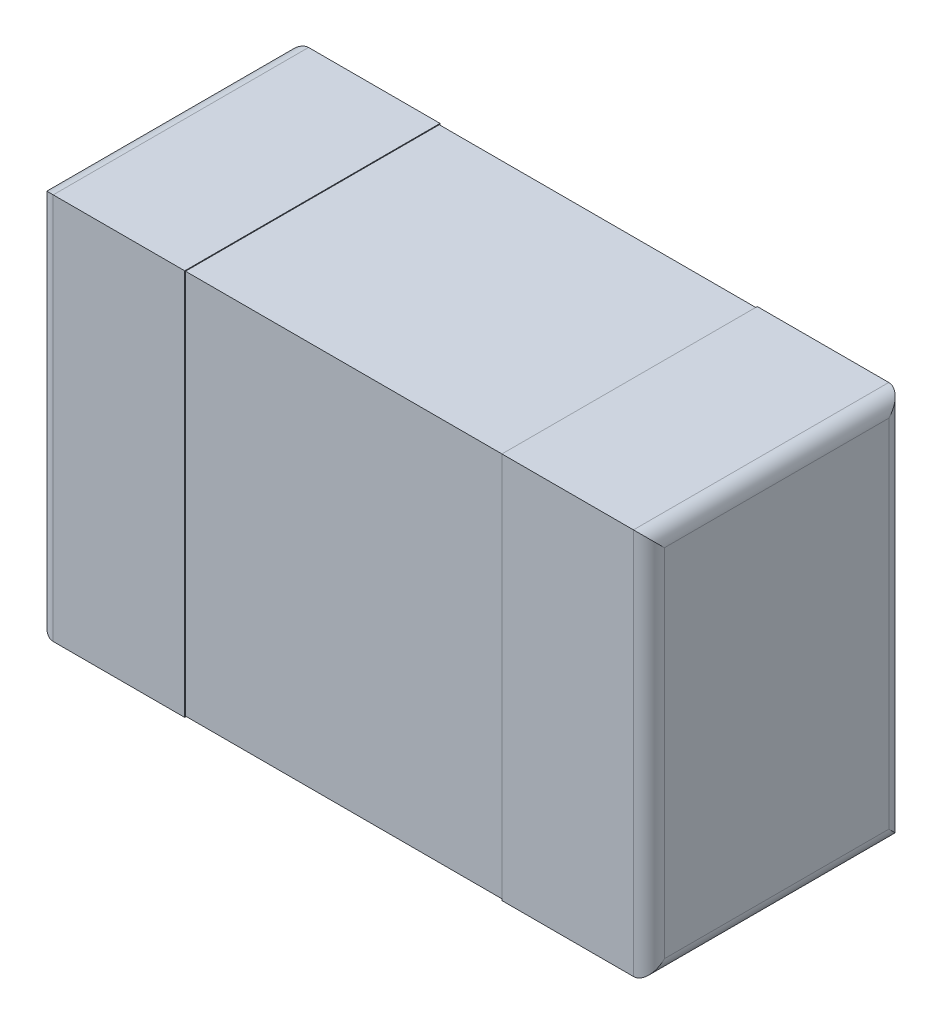
ISO-10303-21;
HEADER;
FILE_DESCRIPTION(('STEP AP214'),'2;1');
FILE_NAME('part.step','',(''),(''),'','','');
FILE_SCHEMA(('AUTOMOTIVE_DESIGN { 1 0 10303 214 1 1 1 1 }'));
ENDSEC;
DATA;
#1=APPLICATION_CONTEXT('core data for automotive mechanical design processes');
#2=APPLICATION_PROTOCOL_DEFINITION('international standard','automotive_design',2000,#1);
#3=PRODUCT_CONTEXT('',#1,'mechanical');
#4=PRODUCT('Part','Part','',(#3));
#5=PRODUCT_RELATED_PRODUCT_CATEGORY('part','',(#4));
#6=PRODUCT_DEFINITION_FORMATION('','',#4);
#7=PRODUCT_DEFINITION_CONTEXT('part definition',#1,'design');
#8=PRODUCT_DEFINITION('design','',#6,#7);
#9=PRODUCT_DEFINITION_SHAPE('','',#8);
#10=(LENGTH_UNIT() NAMED_UNIT(*) SI_UNIT(.MILLI.,.METRE.));
#11=(NAMED_UNIT(*) PLANE_ANGLE_UNIT() SI_UNIT($,.RADIAN.));
#12=(NAMED_UNIT(*) SI_UNIT($,.STERADIAN.) SOLID_ANGLE_UNIT());
#13=UNCERTAINTY_MEASURE_WITH_UNIT(LENGTH_MEASURE(1.E-05),#10,'distance_accuracy_value','');
#14=(GEOMETRIC_REPRESENTATION_CONTEXT(3) GLOBAL_UNCERTAINTY_ASSIGNED_CONTEXT((#13)) GLOBAL_UNIT_ASSIGNED_CONTEXT((#10,
#11,#12)) REPRESENTATION_CONTEXT('',''));
#15=CARTESIAN_POINT('',(0.,0.,0.));
#16=DIRECTION('',(0.,0.,1.));
#17=DIRECTION('',(1.,0.,0.));
#18=AXIS2_PLACEMENT_3D('',#15,#16,#17);
#19=CARTESIAN_POINT('',(0.,0.,0.));
#20=DIRECTION('',(0.,0.,1.));
#21=DIRECTION('',(1.,0.,0.));
#22=AXIS2_PLACEMENT_3D('',#19,#20,#21);
#23=PLANE('',#22);
#24=DIRECTION('',(-1.,0.,0.));
#25=VECTOR('',#24,1.);
#26=CARTESIAN_POINT('',(2.0066,1.27,0.));
#27=LINE('',#26,#25);
#28=CARTESIAN_POINT('',(1.9558,1.27,0.));
#29=VERTEX_POINT('',#28);
#30=CARTESIAN_POINT('',(1.524,1.27,0.));
#31=VERTEX_POINT('',#30);
#32=EDGE_CURVE('E42',#29,#31,#27,.T.);
#33=ORIENTED_EDGE('',*,*,#32,.F.);
#34=DIRECTION('',(0.,-1.,0.));
#35=VECTOR('',#34,1.);
#36=CARTESIAN_POINT('',(1.9558,0.,0.));
#37=LINE('',#36,#35);
#38=CARTESIAN_POINT('',(1.9558,0.,0.));
#39=VERTEX_POINT('',#38);
#40=EDGE_CURVE('E11',#29,#39,#37,.T.);
#41=ORIENTED_EDGE('',*,*,#40,.T.);
#42=DIRECTION('',(1.,0.,0.));
#43=VECTOR('',#42,1.);
#44=CARTESIAN_POINT('',(0.,0.,0.));
#45=LINE('',#44,#43);
#46=CARTESIAN_POINT('',(1.524,0.,0.));
#47=VERTEX_POINT('',#46);
#48=EDGE_CURVE('E209',#47,#39,#45,.T.);
#49=ORIENTED_EDGE('',*,*,#48,.F.);
#50=DIRECTION('',(0.,1.,0.));
#51=VECTOR('',#50,1.);
#52=CARTESIAN_POINT('',(1.524,0.,0.));
#53=LINE('',#52,#51);
#54=EDGE_CURVE('E29',#47,#31,#53,.T.);
#55=ORIENTED_EDGE('',*,*,#54,.T.);
#56=EDGE_LOOP('',(#33,#41,#49,#55));
#57=FACE_BOUND('',#56,.T.);
#58=ADVANCED_FACE('F18',(#57),#23,.F.);
#59=CARTESIAN_POINT('',(0.,0.,0.));
#60=DIRECTION('',(0.,0.,1.));
#61=DIRECTION('',(1.,0.,0.));
#62=AXIS2_PLACEMENT_3D('',#59,#60,#61);
#63=PLANE('',#62);
#64=DIRECTION('',(1.,0.,0.));
#65=VECTOR('',#64,1.);
#66=CARTESIAN_POINT('',(0.,0.,0.));
#67=LINE('',#66,#65);
#68=CARTESIAN_POINT('',(0.0508,0.,0.));
#69=VERTEX_POINT('',#68);
#70=CARTESIAN_POINT('',(0.4826,0.,0.));
#71=VERTEX_POINT('',#70);
#72=EDGE_CURVE('E237',#69,#71,#67,.T.);
#73=ORIENTED_EDGE('',*,*,#72,.F.);
#74=DIRECTION('',(0.,1.,0.));
#75=VECTOR('',#74,1.);
#76=CARTESIAN_POINT('',(0.0508,0.,0.));
#77=LINE('',#76,#75);
#78=CARTESIAN_POINT('',(0.0508,1.27,0.));
#79=VERTEX_POINT('',#78);
#80=EDGE_CURVE('E252',#69,#79,#77,.T.);
#81=ORIENTED_EDGE('',*,*,#80,.T.);
#82=DIRECTION('',(-1.,0.,0.));
#83=VECTOR('',#82,1.);
#84=CARTESIAN_POINT('',(2.0066,1.27,0.));
#85=LINE('',#84,#83);
#86=CARTESIAN_POINT('',(0.4826,1.27,0.));
#87=VERTEX_POINT('',#86);
#88=EDGE_CURVE('E210',#87,#79,#85,.T.);
#89=ORIENTED_EDGE('',*,*,#88,.F.);
#90=DIRECTION('',(0.,-1.,0.));
#91=VECTOR('',#90,1.);
#92=CARTESIAN_POINT('',(0.4826,0.,0.));
#93=LINE('',#92,#91);
#94=EDGE_CURVE('E256',#87,#71,#93,.T.);
#95=ORIENTED_EDGE('',*,*,#94,.T.);
#96=EDGE_LOOP('',(#73,#81,#89,#95));
#97=FACE_BOUND('',#96,.T.);
#98=ADVANCED_FACE('F386',(#97),#63,.F.);
#99=CARTESIAN_POINT('',(1.524,0.00254000000000009,-1.68265745417451));
#100=DIRECTION('',(0.,1.,0.));
#101=DIRECTION('',(1.,0.,0.));
#102=AXIS2_PLACEMENT_3D('',#99,#100,#101);
#103=PLANE('',#102);
#104=DIRECTION('',(-1.,0.,0.));
#105=VECTOR('',#104,1.);
#106=CARTESIAN_POINT('',(1.524,0.00254000000000009,0.00253999999999988));
#107=LINE('',#106,#105);
#108=CARTESIAN_POINT('',(1.524,0.00254000000000009,0.0025399999999999));
#109=VERTEX_POINT('',#108);
#110=CARTESIAN_POINT('',(0.4826,0.00254000000000009,0.0025399999999999));
#111=VERTEX_POINT('',#110);
#112=EDGE_CURVE('E235',#109,#111,#107,.T.);
#113=ORIENTED_EDGE('',*,*,#112,.F.);
#114=DIRECTION('',(0.,0.,1.));
#115=VECTOR('',#114,1.);
#116=CARTESIAN_POINT('',(1.524,0.00254000000000009,-1.68265745417451));
#117=LINE('',#116,#115);
#118=CARTESIAN_POINT('',(1.524,0.00254000000000009,0.83566));
#119=VERTEX_POINT('',#118);
#120=EDGE_CURVE('E186',#109,#119,#117,.T.);
#121=ORIENTED_EDGE('',*,*,#120,.T.);
#122=DIRECTION('',(-1.,0.,0.));
#123=VECTOR('',#122,1.);
#124=CARTESIAN_POINT('',(1.524,0.00254000000000009,0.83566));
#125=LINE('',#124,#123);
#126=CARTESIAN_POINT('',(0.4826,0.00254,0.83566));
#127=VERTEX_POINT('',#126);
#128=EDGE_CURVE('E183',#119,#127,#125,.T.);
#129=ORIENTED_EDGE('',*,*,#128,.T.);
#130=DIRECTION('',(0.,0.,1.));
#131=VECTOR('',#130,1.);
#132=CARTESIAN_POINT('',(0.4826,0.00254,-1.68265745417451));
#133=LINE('',#132,#131);
#134=EDGE_CURVE('E170',#111,#127,#133,.T.);
#135=ORIENTED_EDGE('',*,*,#134,.F.);
#136=EDGE_LOOP('',(#113,#121,#129,#135));
#137=FACE_BOUND('',#136,.T.);
#138=ADVANCED_FACE('F184',(#137),#103,.F.);
#139=CARTESIAN_POINT('',(0.4826,1.26746,-1.68265745417451));
#140=DIRECTION('',(0.,-1.,0.));
#141=DIRECTION('',(0.,0.,-1.));
#142=AXIS2_PLACEMENT_3D('',#139,#140,#141);
#143=PLANE('',#142);
#144=DIRECTION('',(1.,0.,0.));
#145=VECTOR('',#144,1.);
#146=CARTESIAN_POINT('',(0.4826,1.26746,0.00253999999999988));
#147=LINE('',#146,#145);
#148=CARTESIAN_POINT('',(0.4826,1.26746,0.0025399999999999));
#149=VERTEX_POINT('',#148);
#150=CARTESIAN_POINT('',(1.524,1.26746,0.0025399999999999));
#151=VERTEX_POINT('',#150);
#152=EDGE_CURVE('E231',#149,#151,#147,.T.);
#153=ORIENTED_EDGE('',*,*,#152,.F.);
#154=DIRECTION('',(0.,0.,1.));
#155=VECTOR('',#154,1.);
#156=CARTESIAN_POINT('',(0.4826,1.26746,-1.68265745417451));
#157=LINE('',#156,#155);
#158=CARTESIAN_POINT('',(0.4826,1.26746,0.83566));
#159=VERTEX_POINT('',#158);
#160=EDGE_CURVE('E191',#149,#159,#157,.T.);
#161=ORIENTED_EDGE('',*,*,#160,.T.);
#162=DIRECTION('',(1.,0.,0.));
#163=VECTOR('',#162,1.);
#164=CARTESIAN_POINT('',(0.4826,1.26746,0.83566));
#165=LINE('',#164,#163);
#166=CARTESIAN_POINT('',(1.524,1.26746,0.83566));
#167=VERTEX_POINT('',#166);
#168=EDGE_CURVE('E195',#159,#167,#165,.T.);
#169=ORIENTED_EDGE('',*,*,#168,.T.);
#170=DIRECTION('',(0.,0.,1.));
#171=VECTOR('',#170,1.);
#172=CARTESIAN_POINT('',(1.524,1.26746,-1.68265745417451));
#173=LINE('',#172,#171);
#174=EDGE_CURVE('E203',#151,#167,#173,.T.);
#175=ORIENTED_EDGE('',*,*,#174,.F.);
#176=EDGE_LOOP('',(#153,#161,#169,#175));
#177=FACE_BOUND('',#176,.T.);
#178=ADVANCED_FACE('F449',(#177),#143,.F.);
#179=CARTESIAN_POINT('',(2.0066,1.27,0.8382));
#180=DIRECTION('',(0.,-1.,0.));
#181=DIRECTION('',(0.,0.,-1.));
#182=AXIS2_PLACEMENT_3D('',#179,#180,#181);
#183=PLANE('',#182);
#184=DIRECTION('',(-1.,0.,0.));
#185=VECTOR('',#184,1.);
#186=CARTESIAN_POINT('',(2.0066,1.27,0.8382));
#187=LINE('',#186,#185);
#188=CARTESIAN_POINT('',(1.9558,1.27,0.8382));
#189=VERTEX_POINT('',#188);
#190=CARTESIAN_POINT('',(1.524,1.27,0.8382));
#191=VERTEX_POINT('',#190);
#192=EDGE_CURVE('E291',#189,#191,#187,.T.);
#193=ORIENTED_EDGE('',*,*,#192,.F.);
#194=DIRECTION('',(0.,0.,-1.));
#195=VECTOR('',#194,1.);
#196=CARTESIAN_POINT('',(1.9558,1.27,0.8382));
#197=LINE('',#196,#195);
#198=EDGE_CURVE('E211',#189,#29,#197,.T.);
#199=ORIENTED_EDGE('',*,*,#198,.T.);
#200=ORIENTED_EDGE('',*,*,#32,.T.);
#201=DIRECTION('',(0.,0.,1.));
#202=VECTOR('',#201,1.);
#203=CARTESIAN_POINT('',(1.524,1.27,0.83566));
#204=LINE('',#203,#202);
#205=EDGE_CURVE('E260',#31,#191,#204,.T.);
#206=ORIENTED_EDGE('',*,*,#205,.T.);
#207=EDGE_LOOP('',(#193,#199,#200,#206));
#208=FACE_BOUND('',#207,.T.);
#209=ADVANCED_FACE('F369',(#208),#183,.F.);
#210=CARTESIAN_POINT('',(0.,0.,0.8382));
#211=DIRECTION('',(0.,1.,0.));
#212=DIRECTION('',(1.,0.,0.));
#213=AXIS2_PLACEMENT_3D('',#210,#211,#212);
#214=PLANE('',#213);
#215=DIRECTION('',(1.,0.,0.));
#216=VECTOR('',#215,1.);
#217=CARTESIAN_POINT('',(0.,0.,0.8382));
#218=LINE('',#217,#216);
#219=CARTESIAN_POINT('',(0.0508,0.,0.8382));
#220=VERTEX_POINT('',#219);
#221=CARTESIAN_POINT('',(0.4826,0.,0.8382));
#222=VERTEX_POINT('',#221);
#223=EDGE_CURVE('E296',#220,#222,#218,.T.);
#224=ORIENTED_EDGE('',*,*,#223,.F.);
#225=DIRECTION('',(0.,0.,-1.));
#226=VECTOR('',#225,1.);
#227=CARTESIAN_POINT('',(0.0508,0.,0.8382));
#228=LINE('',#227,#226);
#229=EDGE_CURVE('E241',#220,#69,#228,.T.);
#230=ORIENTED_EDGE('',*,*,#229,.T.);
#231=ORIENTED_EDGE('',*,*,#72,.T.);
#232=DIRECTION('',(0.,0.,1.));
#233=VECTOR('',#232,1.);
#234=CARTESIAN_POINT('',(0.4826,0.,0.83566));
#235=LINE('',#234,#233);
#236=EDGE_CURVE('E242',#71,#222,#235,.T.);
#237=ORIENTED_EDGE('',*,*,#236,.T.);
#238=EDGE_LOOP('',(#224,#230,#231,#237));
#239=FACE_BOUND('',#238,.T.);
#240=ADVANCED_FACE('F420',(#239),#214,.F.);
#241=CARTESIAN_POINT('',(0.,0.,0.8382));
#242=DIRECTION('',(0.,1.,0.));
#243=DIRECTION('',(1.,0.,0.));
#244=AXIS2_PLACEMENT_3D('',#241,#242,#243);
#245=PLANE('',#244);
#246=ORIENTED_EDGE('',*,*,#48,.T.);
#247=DIRECTION('',(0.,0.,1.));
#248=VECTOR('',#247,1.);
#249=CARTESIAN_POINT('',(1.9558,0.,0.8382));
#250=LINE('',#249,#248);
#251=CARTESIAN_POINT('',(1.9558,0.,0.8382));
#252=VERTEX_POINT('',#251);
#253=EDGE_CURVE('E206',#39,#252,#250,.T.);
#254=ORIENTED_EDGE('',*,*,#253,.T.);
#255=DIRECTION('',(1.,0.,0.));
#256=VECTOR('',#255,1.);
#257=CARTESIAN_POINT('',(0.,0.,0.8382));
#258=LINE('',#257,#256);
#259=CARTESIAN_POINT('',(1.524,0.,0.8382));
#260=VERTEX_POINT('',#259);
#261=EDGE_CURVE('E297',#260,#252,#258,.T.);
#262=ORIENTED_EDGE('',*,*,#261,.F.);
#263=DIRECTION('',(0.,0.,1.));
#264=VECTOR('',#263,1.);
#265=CARTESIAN_POINT('',(1.524,0.,0.83566));
#266=LINE('',#265,#264);
#267=EDGE_CURVE('E22',#47,#260,#266,.T.);
#268=ORIENTED_EDGE('',*,*,#267,.F.);
#269=EDGE_LOOP('',(#246,#254,#262,#268));
#270=FACE_BOUND('',#269,.T.);
#271=ADVANCED_FACE('F418',(#270),#245,.F.);
#272=CARTESIAN_POINT('',(2.0066,1.27,0.8382));
#273=DIRECTION('',(0.,-1.,0.));
#274=DIRECTION('',(0.,0.,-1.));
#275=AXIS2_PLACEMENT_3D('',#272,#273,#274);
#276=PLANE('',#275);
#277=ORIENTED_EDGE('',*,*,#88,.T.);
#278=DIRECTION('',(0.,0.,1.));
#279=VECTOR('',#278,1.);
#280=CARTESIAN_POINT('',(0.0508,1.27,0.8382));
#281=LINE('',#280,#279);
#282=CARTESIAN_POINT('',(0.0508,1.27,0.8382));
#283=VERTEX_POINT('',#282);
#284=EDGE_CURVE('E243',#79,#283,#281,.T.);
#285=ORIENTED_EDGE('',*,*,#284,.T.);
#286=DIRECTION('',(-1.,0.,0.));
#287=VECTOR('',#286,1.);
#288=CARTESIAN_POINT('',(2.0066,1.27,0.8382));
#289=LINE('',#288,#287);
#290=CARTESIAN_POINT('',(0.4826,1.27,0.8382));
#291=VERTEX_POINT('',#290);
#292=EDGE_CURVE('E247',#291,#283,#289,.T.);
#293=ORIENTED_EDGE('',*,*,#292,.F.);
#294=DIRECTION('',(0.,0.,1.));
#295=VECTOR('',#294,1.);
#296=CARTESIAN_POINT('',(0.4826,1.27,0.83566));
#297=LINE('',#296,#295);
#298=EDGE_CURVE('E198',#87,#291,#297,.T.);
#299=ORIENTED_EDGE('',*,*,#298,.F.);
#300=EDGE_LOOP('',(#277,#285,#293,#299));
#301=FACE_BOUND('',#300,.T.);
#302=ADVANCED_FACE('F397',(#301),#276,.F.);
#303=CARTESIAN_POINT('',(0.,0.,0.8382));
#304=DIRECTION('',(0.,0.,1.));
#305=DIRECTION('',(1.,0.,0.));
#306=AXIS2_PLACEMENT_3D('',#303,#304,#305);
#307=PLANE('',#306);
#308=ORIENTED_EDGE('',*,*,#292,.T.);
#309=DIRECTION('',(0.,-1.,0.));
#310=VECTOR('',#309,1.);
#311=CARTESIAN_POINT('',(0.0508,0.,0.8382));
#312=LINE('',#311,#310);
#313=EDGE_CURVE('E158',#283,#220,#312,.T.);
#314=ORIENTED_EDGE('',*,*,#313,.T.);
#315=ORIENTED_EDGE('',*,*,#223,.T.);
#316=DIRECTION('',(0.,1.,0.));
#317=VECTOR('',#316,1.);
#318=CARTESIAN_POINT('',(0.4826,0.,0.8382));
#319=LINE('',#318,#317);
#320=EDGE_CURVE('E292',#222,#291,#319,.T.);
#321=ORIENTED_EDGE('',*,*,#320,.T.);
#322=EDGE_LOOP('',(#308,#314,#315,#321));
#323=FACE_BOUND('',#322,.T.);
#324=ADVANCED_FACE('F394',(#323),#307,.T.);
#325=CARTESIAN_POINT('',(0.,0.,0.8382));
#326=DIRECTION('',(0.,0.,1.));
#327=DIRECTION('',(1.,0.,0.));
#328=AXIS2_PLACEMENT_3D('',#325,#326,#327);
#329=PLANE('',#328);
#330=ORIENTED_EDGE('',*,*,#261,.T.);
#331=DIRECTION('',(0.,1.,0.));
#332=VECTOR('',#331,1.);
#333=CARTESIAN_POINT('',(1.9558,1.27,0.8382));
#334=LINE('',#333,#332);
#335=EDGE_CURVE('E316',#252,#189,#334,.T.);
#336=ORIENTED_EDGE('',*,*,#335,.T.);
#337=ORIENTED_EDGE('',*,*,#192,.T.);
#338=DIRECTION('',(0.,-1.,0.));
#339=VECTOR('',#338,1.);
#340=CARTESIAN_POINT('',(1.524,1.27,0.8382));
#341=LINE('',#340,#339);
#342=EDGE_CURVE('E287',#191,#260,#341,.T.);
#343=ORIENTED_EDGE('',*,*,#342,.T.);
#344=EDGE_LOOP('',(#330,#336,#337,#343));
#345=FACE_BOUND('',#344,.T.);
#346=ADVANCED_FACE('F20',(#345),#329,.T.);
#347=CARTESIAN_POINT('',(0.,1.27,0.8382));
#348=DIRECTION('',(1.,0.,0.));
#349=DIRECTION('',(0.,1.,0.));
#350=AXIS2_PLACEMENT_3D('',#347,#348,#349);
#351=PLANE('',#350);
#352=DIRECTION('',(0.,-1.,0.));
#353=VECTOR('',#352,1.);
#354=CARTESIAN_POINT('',(0.,1.27,0.0508));
#355=LINE('',#354,#353);
#356=CARTESIAN_POINT('',(0.,1.2192,0.0508));
#357=VERTEX_POINT('',#356);
#358=CARTESIAN_POINT('',(0.,0.0508,0.0508));
#359=VERTEX_POINT('',#358);
#360=EDGE_CURVE('E224',#357,#359,#355,.T.);
#361=ORIENTED_EDGE('',*,*,#360,.T.);
#362=DIRECTION('',(0.,0.,1.));
#363=VECTOR('',#362,1.);
#364=CARTESIAN_POINT('',(0.,0.0508,0.8382));
#365=LINE('',#364,#363);
#366=CARTESIAN_POINT('',(0.,0.0508,0.7874));
#367=VERTEX_POINT('',#366);
#368=EDGE_CURVE('E220',#359,#367,#365,.T.);
#369=ORIENTED_EDGE('',*,*,#368,.T.);
#370=DIRECTION('',(0.,1.,0.));
#371=VECTOR('',#370,1.);
#372=CARTESIAN_POINT('',(0.,1.27,0.7874));
#373=LINE('',#372,#371);
#374=CARTESIAN_POINT('',(0.,1.2192,0.7874));
#375=VERTEX_POINT('',#374);
#376=EDGE_CURVE('E225',#367,#375,#373,.T.);
#377=ORIENTED_EDGE('',*,*,#376,.T.);
#378=DIRECTION('',(0.,0.,-1.));
#379=VECTOR('',#378,1.);
#380=CARTESIAN_POINT('',(0.,1.2192,0.8382));
#381=LINE('',#380,#379);
#382=EDGE_CURVE('E264',#375,#357,#381,.T.);
#383=ORIENTED_EDGE('',*,*,#382,.T.);
#384=EDGE_LOOP('',(#361,#369,#377,#383));
#385=FACE_BOUND('',#384,.T.);
#386=ADVANCED_FACE('F462',(#385),#351,.F.);
#387=CARTESIAN_POINT('',(2.0066,0.,0.8382));
#388=DIRECTION('',(-1.,0.,0.));
#389=DIRECTION('',(0.,0.,1.));
#390=AXIS2_PLACEMENT_3D('',#387,#388,#389);
#391=PLANE('',#390);
#392=DIRECTION('',(0.,1.,0.));
#393=VECTOR('',#392,1.);
#394=CARTESIAN_POINT('',(2.0066,0.,0.0508));
#395=LINE('',#394,#393);
#396=CARTESIAN_POINT('',(2.0066,0.0508,0.0508));
#397=VERTEX_POINT('',#396);
#398=CARTESIAN_POINT('',(2.0066,1.2192,0.0508));
#399=VERTEX_POINT('',#398);
#400=EDGE_CURVE('E268',#397,#399,#395,.T.);
#401=ORIENTED_EDGE('',*,*,#400,.T.);
#402=DIRECTION('',(0.,0.,1.));
#403=VECTOR('',#402,1.);
#404=CARTESIAN_POINT('',(2.0066,1.2192,0.8382));
#405=LINE('',#404,#403);
#406=CARTESIAN_POINT('',(2.0066,1.2192,0.7874));
#407=VERTEX_POINT('',#406);
#408=EDGE_CURVE('E271',#399,#407,#405,.T.);
#409=ORIENTED_EDGE('',*,*,#408,.T.);
#410=DIRECTION('',(0.,-1.,0.));
#411=VECTOR('',#410,1.);
#412=CARTESIAN_POINT('',(2.0066,0.,0.7874));
#413=LINE('',#412,#411);
#414=CARTESIAN_POINT('',(2.0066,0.0508,0.7874));
#415=VERTEX_POINT('',#414);
#416=EDGE_CURVE('E275',#407,#415,#413,.T.);
#417=ORIENTED_EDGE('',*,*,#416,.T.);
#418=DIRECTION('',(0.,0.,-1.));
#419=VECTOR('',#418,1.);
#420=CARTESIAN_POINT('',(2.0066,0.0508,0.8382));
#421=LINE('',#420,#419);
#422=EDGE_CURVE('E355',#415,#397,#421,.T.);
#423=ORIENTED_EDGE('',*,*,#422,.T.);
#424=EDGE_LOOP('',(#401,#409,#417,#423));
#425=FACE_BOUND('',#424,.T.);
#426=ADVANCED_FACE('F381',(#425),#391,.F.);
#427=CARTESIAN_POINT('',(0.4826,0.,0.83566));
#428=DIRECTION('',(1.,0.,0.));
#429=DIRECTION('',(0.,1.,0.));
#430=AXIS2_PLACEMENT_3D('',#427,#428,#429);
#431=PLANE('',#430);
#432=ORIENTED_EDGE('',*,*,#160,.F.);
#433=DIRECTION('',(0.,-1.,0.));
#434=VECTOR('',#433,1.);
#435=CARTESIAN_POINT('',(0.4826,2.51831745417451,0.0025399999999999));
#436=LINE('',#435,#434);
#437=EDGE_CURVE('E178',#149,#111,#436,.T.);
#438=ORIENTED_EDGE('',*,*,#437,.T.);
#439=ORIENTED_EDGE('',*,*,#134,.T.);
#440=DIRECTION('',(0.,1.,0.));
#441=VECTOR('',#440,1.);
#442=CARTESIAN_POINT('',(0.4826,0.,0.83566));
#443=LINE('',#442,#441);
#444=EDGE_CURVE('E176',#127,#159,#443,.T.);
#445=ORIENTED_EDGE('',*,*,#444,.T.);
#446=EDGE_LOOP('',(#432,#438,#439,#445));
#447=FACE_BOUND('',#446,.T.);
#448=ORIENTED_EDGE('',*,*,#298,.T.);
#449=ORIENTED_EDGE('',*,*,#320,.F.);
#450=ORIENTED_EDGE('',*,*,#236,.F.);
#451=ORIENTED_EDGE('',*,*,#94,.F.);
#452=EDGE_LOOP('',(#448,#449,#450,#451));
#453=FACE_BOUND('',#452,.T.);
#454=ADVANCED_FACE('F173',(#447,#453),#431,.T.);
#455=CARTESIAN_POINT('',(1.524,1.27,0.83566));
#456=DIRECTION('',(-1.,0.,0.));
#457=DIRECTION('',(0.,0.,1.));
#458=AXIS2_PLACEMENT_3D('',#455,#456,#457);
#459=PLANE('',#458);
#460=DIRECTION('',(0.,-1.,0.));
#461=VECTOR('',#460,1.);
#462=CARTESIAN_POINT('',(1.524,2.51831745417451,0.0025399999999999));
#463=LINE('',#462,#461);
#464=EDGE_CURVE('E236',#151,#109,#463,.T.);
#465=ORIENTED_EDGE('',*,*,#464,.F.);
#466=ORIENTED_EDGE('',*,*,#174,.T.);
#467=DIRECTION('',(0.,-1.,0.));
#468=VECTOR('',#467,1.);
#469=CARTESIAN_POINT('',(1.524,1.27,0.83566));
#470=LINE('',#469,#468);
#471=EDGE_CURVE('E329',#167,#119,#470,.T.);
#472=ORIENTED_EDGE('',*,*,#471,.T.);
#473=ORIENTED_EDGE('',*,*,#120,.F.);
#474=EDGE_LOOP('',(#465,#466,#472,#473));
#475=FACE_BOUND('',#474,.T.);
#476=ORIENTED_EDGE('',*,*,#267,.T.);
#477=ORIENTED_EDGE('',*,*,#342,.F.);
#478=ORIENTED_EDGE('',*,*,#205,.F.);
#479=ORIENTED_EDGE('',*,*,#54,.F.);
#480=EDGE_LOOP('',(#476,#477,#478,#479));
#481=FACE_BOUND('',#480,.T.);
#482=ADVANCED_FACE('F370',(#475,#481),#459,.T.);
#483=CARTESIAN_POINT('',(0.,0.,0.83566));
#484=DIRECTION('',(0.,0.,-1.));
#485=DIRECTION('',(0.,-1.,0.));
#486=AXIS2_PLACEMENT_3D('',#483,#484,#485);
#487=PLANE('',#486);
#488=ORIENTED_EDGE('',*,*,#471,.F.);
#489=ORIENTED_EDGE('',*,*,#168,.F.);
#490=ORIENTED_EDGE('',*,*,#444,.F.);
#491=ORIENTED_EDGE('',*,*,#128,.F.);
#492=EDGE_LOOP('',(#488,#489,#490,#491));
#493=FACE_BOUND('',#492,.T.);
#494=ADVANCED_FACE('F193',(#493),#487,.F.);
#495=CARTESIAN_POINT('',(0.4826,2.51831745417451,0.0025399999999999));
#496=DIRECTION('',(0.,0.,-1.));
#497=DIRECTION('',(0.,-1.,0.));
#498=AXIS2_PLACEMENT_3D('',#495,#496,#497);
#499=PLANE('',#498);
#500=ORIENTED_EDGE('',*,*,#112,.T.);
#501=ORIENTED_EDGE('',*,*,#437,.F.);
#502=ORIENTED_EDGE('',*,*,#152,.T.);
#503=ORIENTED_EDGE('',*,*,#464,.T.);
#504=EDGE_LOOP('',(#500,#501,#502,#503));
#505=FACE_BOUND('',#504,.T.);
#506=ADVANCED_FACE('F379',(#505),#499,.T.);
#507=CARTESIAN_POINT('',(0.0508,1.2192,0.8382));
#508=DIRECTION('',(0.,0.,-1.));
#509=DIRECTION('',(-1.,0.,0.));
#510=AXIS2_PLACEMENT_3D('',#507,#508,#509);
#511=CYLINDRICAL_SURFACE('',#510,0.0508);
#512=CARTESIAN_POINT('',(0.0508,1.2192,0.0508));
#513=DIRECTION('',(0.,-0.707106781186548,-0.707106781186548));
#514=DIRECTION('',(0.,0.707106781186548,-0.707106781186548));
#515=AXIS2_PLACEMENT_3D('',#512,#513,#514);
#516=ELLIPSE('',#515,0.0718420489685533,0.0508);
#517=EDGE_CURVE('E251',#357,#79,#516,.T.);
#518=ORIENTED_EDGE('',*,*,#517,.F.);
#519=ORIENTED_EDGE('',*,*,#382,.F.);
#520=CARTESIAN_POINT('',(0.0508,1.2192,0.7874));
#521=DIRECTION('',(0.,-0.707106781186548,0.707106781186548));
#522=DIRECTION('',(0.,-0.707106781186548,-0.707106781186548));
#523=AXIS2_PLACEMENT_3D('',#520,#521,#522);
#524=ELLIPSE('',#523,0.0718420489685533,0.0508);
#525=EDGE_CURVE('E248',#283,#375,#524,.T.);
#526=ORIENTED_EDGE('',*,*,#525,.F.);
#527=ORIENTED_EDGE('',*,*,#284,.F.);
#528=EDGE_LOOP('',(#518,#519,#526,#527));
#529=FACE_BOUND('',#528,.T.);
#530=ADVANCED_FACE('F461',(#529),#511,.T.);
#531=CARTESIAN_POINT('',(0.0508,0.,0.7874));
#532=DIRECTION('',(0.,1.,0.));
#533=DIRECTION('',(-1.,0.,0.));
#534=AXIS2_PLACEMENT_3D('',#531,#532,#533);
#535=CYLINDRICAL_SURFACE('',#534,0.0508);
#536=ORIENTED_EDGE('',*,*,#525,.T.);
#537=ORIENTED_EDGE('',*,*,#376,.F.);
#538=CARTESIAN_POINT('',(0.0508,0.0508,0.7874));
#539=DIRECTION('',(0.,-0.707106781186548,-0.707106781186548));
#540=DIRECTION('',(0.,0.707106781186548,-0.707106781186548));
#541=AXIS2_PLACEMENT_3D('',#538,#539,#540);
#542=ELLIPSE('',#541,0.0718420489685533,0.0508);
#543=EDGE_CURVE('E333',#220,#367,#542,.T.);
#544=ORIENTED_EDGE('',*,*,#543,.F.);
#545=ORIENTED_EDGE('',*,*,#313,.F.);
#546=EDGE_LOOP('',(#536,#537,#544,#545));
#547=FACE_BOUND('',#546,.T.);
#548=ADVANCED_FACE('F411',(#547),#535,.T.);
#549=CARTESIAN_POINT('',(0.0508,1.27,0.0508));
#550=DIRECTION('',(0.,-1.,0.));
#551=DIRECTION('',(1.,0.,0.));
#552=AXIS2_PLACEMENT_3D('',#549,#550,#551);
#553=CYLINDRICAL_SURFACE('',#552,0.0508);
#554=ORIENTED_EDGE('',*,*,#517,.T.);
#555=ORIENTED_EDGE('',*,*,#80,.F.);
#556=CARTESIAN_POINT('',(0.0508,0.0508,0.0508));
#557=DIRECTION('',(0.,-0.707106781186548,0.707106781186548));
#558=DIRECTION('',(0.,-0.707106781186548,-0.707106781186548));
#559=AXIS2_PLACEMENT_3D('',#556,#557,#558);
#560=ELLIPSE('',#559,0.0718420489685533,0.0508);
#561=EDGE_CURVE('E229',#359,#69,#560,.T.);
#562=ORIENTED_EDGE('',*,*,#561,.F.);
#563=ORIENTED_EDGE('',*,*,#360,.F.);
#564=EDGE_LOOP('',(#554,#555,#562,#563));
#565=FACE_BOUND('',#564,.T.);
#566=ADVANCED_FACE('F403',(#565),#553,.T.);
#567=CARTESIAN_POINT('',(0.0508,0.0508,0.8382));
#568=DIRECTION('',(0.,0.,-1.));
#569=DIRECTION('',(-1.,0.,0.));
#570=AXIS2_PLACEMENT_3D('',#567,#568,#569);
#571=CYLINDRICAL_SURFACE('',#570,0.0508);
#572=ORIENTED_EDGE('',*,*,#543,.T.);
#573=ORIENTED_EDGE('',*,*,#368,.F.);
#574=ORIENTED_EDGE('',*,*,#561,.T.);
#575=ORIENTED_EDGE('',*,*,#229,.F.);
#576=EDGE_LOOP('',(#572,#573,#574,#575));
#577=FACE_BOUND('',#576,.T.);
#578=ADVANCED_FACE('F399',(#577),#571,.T.);
#579=CARTESIAN_POINT('',(1.9558,0.0508,0.8382));
#580=DIRECTION('',(0.,0.,-1.));
#581=DIRECTION('',(-1.,0.,0.));
#582=AXIS2_PLACEMENT_3D('',#579,#580,#581);
#583=CYLINDRICAL_SURFACE('',#582,0.0508);
#584=CARTESIAN_POINT('',(1.9558,0.0508,0.0508));
#585=DIRECTION('',(0.,0.707106781186548,-0.707106781186548));
#586=DIRECTION('',(0.,-0.707106781186548,-0.707106781186548));
#587=AXIS2_PLACEMENT_3D('',#584,#585,#586);
#588=ELLIPSE('',#587,0.0718420489685533,0.0508);
#589=EDGE_CURVE('E218',#397,#39,#588,.T.);
#590=ORIENTED_EDGE('',*,*,#589,.F.);
#591=ORIENTED_EDGE('',*,*,#422,.F.);
#592=CARTESIAN_POINT('',(1.9558,0.0508,0.7874));
#593=DIRECTION('',(0.,0.707106781186548,0.707106781186548));
#594=DIRECTION('',(0.,0.707106781186548,-0.707106781186548));
#595=AXIS2_PLACEMENT_3D('',#592,#593,#594);
#596=ELLIPSE('',#595,0.0718420489685533,0.0508);
#597=EDGE_CURVE('E226',#252,#415,#596,.T.);
#598=ORIENTED_EDGE('',*,*,#597,.F.);
#599=ORIENTED_EDGE('',*,*,#253,.F.);
#600=EDGE_LOOP('',(#590,#591,#598,#599));
#601=FACE_BOUND('',#600,.T.);
#602=ADVANCED_FACE('F402',(#601),#583,.T.);
#603=CARTESIAN_POINT('',(1.9558,0.,0.7874));
#604=DIRECTION('',(0.,-1.,0.));
#605=DIRECTION('',(0.,0.,-1.));
#606=AXIS2_PLACEMENT_3D('',#603,#604,#605);
#607=CYLINDRICAL_SURFACE('',#606,0.0508);
#608=ORIENTED_EDGE('',*,*,#597,.T.);
#609=ORIENTED_EDGE('',*,*,#416,.F.);
#610=CARTESIAN_POINT('',(1.9558,1.2192,0.7874));
#611=DIRECTION('',(0.,0.707106781186548,-0.707106781186548));
#612=DIRECTION('',(0.,-0.707106781186548,-0.707106781186548));
#613=AXIS2_PLACEMENT_3D('',#610,#611,#612);
#614=ELLIPSE('',#613,0.0718420489685533,0.0508);
#615=EDGE_CURVE('E214',#189,#407,#614,.T.);
#616=ORIENTED_EDGE('',*,*,#615,.F.);
#617=ORIENTED_EDGE('',*,*,#335,.F.);
#618=EDGE_LOOP('',(#608,#609,#616,#617));
#619=FACE_BOUND('',#618,.T.);
#620=ADVANCED_FACE('F407',(#619),#607,.T.);
#621=CARTESIAN_POINT('',(1.9558,0.,0.0508));
#622=DIRECTION('',(0.,1.,0.));
#623=DIRECTION('',(0.,0.,1.));
#624=AXIS2_PLACEMENT_3D('',#621,#622,#623);
#625=CYLINDRICAL_SURFACE('',#624,0.0508);
#626=ORIENTED_EDGE('',*,*,#589,.T.);
#627=ORIENTED_EDGE('',*,*,#40,.F.);
#628=CARTESIAN_POINT('',(1.9558,1.2192,0.0508));
#629=DIRECTION('',(0.,0.707106781186548,0.707106781186548));
#630=DIRECTION('',(0.,0.707106781186548,-0.707106781186548));
#631=AXIS2_PLACEMENT_3D('',#628,#629,#630);
#632=ELLIPSE('',#631,0.0718420489685533,0.0508);
#633=EDGE_CURVE('E219',#399,#29,#632,.T.);
#634=ORIENTED_EDGE('',*,*,#633,.F.);
#635=ORIENTED_EDGE('',*,*,#400,.F.);
#636=EDGE_LOOP('',(#626,#627,#634,#635));
#637=FACE_BOUND('',#636,.T.);
#638=ADVANCED_FACE('F413',(#637),#625,.T.);
#639=CARTESIAN_POINT('',(1.9558,1.2192,0.8382));
#640=DIRECTION('',(0.,0.,-1.));
#641=DIRECTION('',(-1.,0.,0.));
#642=AXIS2_PLACEMENT_3D('',#639,#640,#641);
#643=CYLINDRICAL_SURFACE('',#642,0.0508);
#644=ORIENTED_EDGE('',*,*,#615,.T.);
#645=ORIENTED_EDGE('',*,*,#408,.F.);
#646=ORIENTED_EDGE('',*,*,#633,.T.);
#647=ORIENTED_EDGE('',*,*,#198,.F.);
#648=EDGE_LOOP('',(#644,#645,#646,#647));
#649=FACE_BOUND('',#648,.T.);
#650=ADVANCED_FACE('F416',(#649),#643,.T.);
#651=CLOSED_SHELL('',(#58,#98,#138,#178,#209,#240,#271,#302,#324,#346,#386,#426,#454,#482,#494,
#506,#530,#548,#566,#578,#602,#620,#638,#650));
#652=MANIFOLD_SOLID_BREP('B1',#651);
#653=ADVANCED_BREP_SHAPE_REPRESENTATION('',(#18,#652),#14);
#654=SHAPE_DEFINITION_REPRESENTATION(#9,#653);
ENDSEC;
END-ISO-10303-21;
